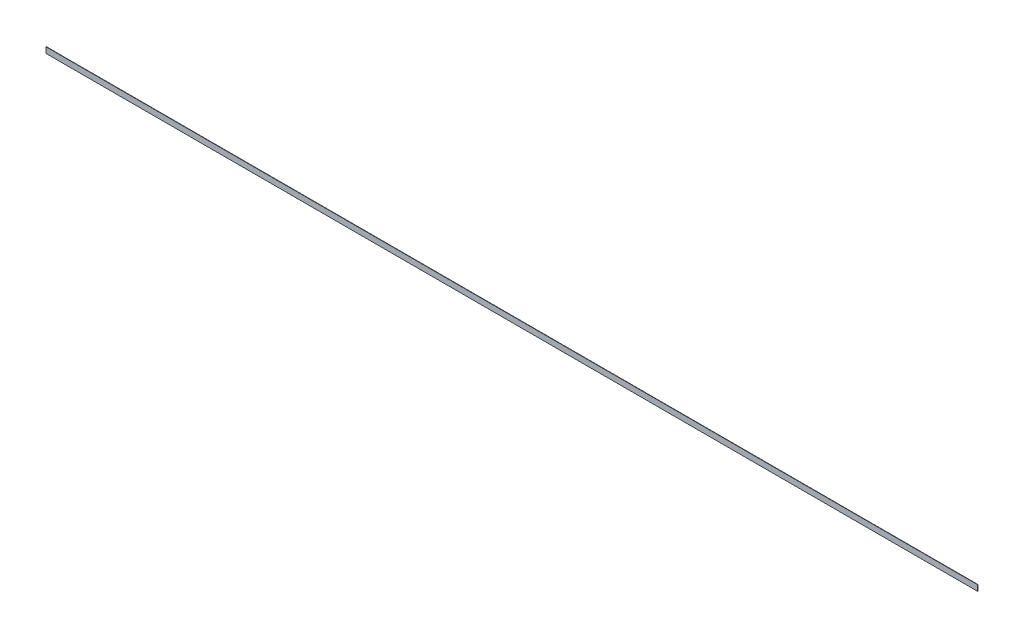
ISO-10303-21;
HEADER;
FILE_DESCRIPTION(('STEP AP214'),'2;1');
FILE_NAME('part.step','',(''),(''),'','','');
FILE_SCHEMA(('AUTOMOTIVE_DESIGN { 1 0 10303 214 1 1 1 1 }'));
ENDSEC;
DATA;
#1=APPLICATION_CONTEXT('core data for automotive mechanical design processes');
#2=APPLICATION_PROTOCOL_DEFINITION('international standard','automotive_design',2000,#1);
#3=PRODUCT_CONTEXT('',#1,'mechanical');
#4=PRODUCT('Part','Part','',(#3));
#5=PRODUCT_RELATED_PRODUCT_CATEGORY('part','',(#4));
#6=PRODUCT_DEFINITION_FORMATION('','',#4);
#7=PRODUCT_DEFINITION_CONTEXT('part definition',#1,'design');
#8=PRODUCT_DEFINITION('design','',#6,#7);
#9=PRODUCT_DEFINITION_SHAPE('','',#8);
#10=(LENGTH_UNIT() NAMED_UNIT(*) SI_UNIT(.MILLI.,.METRE.));
#11=(NAMED_UNIT(*) PLANE_ANGLE_UNIT() SI_UNIT($,.RADIAN.));
#12=(NAMED_UNIT(*) SI_UNIT($,.STERADIAN.) SOLID_ANGLE_UNIT());
#13=UNCERTAINTY_MEASURE_WITH_UNIT(LENGTH_MEASURE(1.E-05),#10,'distance_accuracy_value','');
#14=(GEOMETRIC_REPRESENTATION_CONTEXT(3) GLOBAL_UNCERTAINTY_ASSIGNED_CONTEXT((#13)) GLOBAL_UNIT_ASSIGNED_CONTEXT((#10,
#11,#12)) REPRESENTATION_CONTEXT('',''));
#15=CARTESIAN_POINT('',(0.,0.,0.));
#16=DIRECTION('',(0.,0.,1.));
#17=DIRECTION('',(1.,0.,0.));
#18=AXIS2_PLACEMENT_3D('',#15,#16,#17);
#19=CARTESIAN_POINT('',(-4114.8,25.4,0.));
#20=DIRECTION('',(0.,0.,1.));
#21=DIRECTION('',(1.,0.,0.));
#22=AXIS2_PLACEMENT_3D('',#19,#20,#21);
#23=PLANE('',#22);
#24=DIRECTION('',(1.,0.,0.));
#25=VECTOR('',#24,1.);
#26=CARTESIAN_POINT('',(-4114.8,25.4,0.));
#27=LINE('',#26,#25);
#28=CARTESIAN_POINT('',(-4114.8,25.4,0.));
#29=VERTEX_POINT('',#28);
#30=CARTESIAN_POINT('',(4114.8,25.4,0.));
#31=VERTEX_POINT('',#30);
#32=EDGE_CURVE('E19',#29,#31,#27,.T.);
#33=ORIENTED_EDGE('',*,*,#32,.F.);
#34=DIRECTION('',(0.,1.,0.));
#35=VECTOR('',#34,1.);
#36=CARTESIAN_POINT('',(-4114.8,0.,0.));
#37=LINE('',#36,#35);
#38=CARTESIAN_POINT('',(-4114.8,-25.4,0.));
#39=VERTEX_POINT('',#38);
#40=EDGE_CURVE('E79',#29,#39,#37,.F.);
#41=ORIENTED_EDGE('',*,*,#40,.T.);
#42=DIRECTION('',(1.,0.,0.));
#43=VECTOR('',#42,1.);
#44=CARTESIAN_POINT('',(-4114.8,-25.4,0.));
#45=LINE('',#44,#43);
#46=CARTESIAN_POINT('',(4114.8,-25.4,0.));
#47=VERTEX_POINT('',#46);
#48=EDGE_CURVE('E60',#47,#39,#45,.F.);
#49=ORIENTED_EDGE('',*,*,#48,.F.);
#50=DIRECTION('',(0.,1.,0.));
#51=VECTOR('',#50,1.);
#52=CARTESIAN_POINT('',(4114.8,0.,0.));
#53=LINE('',#52,#51);
#54=EDGE_CURVE('E55',#31,#47,#53,.F.);
#55=ORIENTED_EDGE('',*,*,#54,.F.);
#56=EDGE_LOOP('',(#33,#41,#49,#55));
#57=FACE_BOUND('',#56,.T.);
#58=ADVANCED_FACE('F16',(#57),#23,.T.);
#59=CARTESIAN_POINT('',(-4114.8,25.4,-3.175));
#60=DIRECTION('',(0.,1.,0.));
#61=DIRECTION('',(0.,0.,1.));
#62=AXIS2_PLACEMENT_3D('',#59,#60,#61);
#63=PLANE('',#62);
#64=DIRECTION('',(-1.,0.,0.));
#65=VECTOR('',#64,1.);
#66=CARTESIAN_POINT('',(-4114.8,25.4,-3.175));
#67=LINE('',#66,#65);
#68=CARTESIAN_POINT('',(-4114.8,25.4,-3.175));
#69=VERTEX_POINT('',#68);
#70=CARTESIAN_POINT('',(4114.8,25.4,-3.175));
#71=VERTEX_POINT('',#70);
#72=EDGE_CURVE('E82',#69,#71,#67,.F.);
#73=ORIENTED_EDGE('',*,*,#72,.F.);
#74=DIRECTION('',(0.,0.,-1.));
#75=VECTOR('',#74,1.);
#76=CARTESIAN_POINT('',(-4114.8,25.4,0.));
#77=LINE('',#76,#75);
#78=EDGE_CURVE('E67',#69,#29,#77,.F.);
#79=ORIENTED_EDGE('',*,*,#78,.T.);
#80=ORIENTED_EDGE('',*,*,#32,.T.);
#81=DIRECTION('',(0.,0.,-1.));
#82=VECTOR('',#81,1.);
#83=CARTESIAN_POINT('',(4114.8,25.4,0.));
#84=LINE('',#83,#82);
#85=EDGE_CURVE('E62',#71,#31,#84,.F.);
#86=ORIENTED_EDGE('',*,*,#85,.F.);
#87=EDGE_LOOP('',(#73,#79,#80,#86));
#88=FACE_BOUND('',#87,.T.);
#89=ADVANCED_FACE('F64',(#88),#63,.T.);
#90=CARTESIAN_POINT('',(4114.8,0.,0.));
#91=DIRECTION('',(1.,0.,0.));
#92=DIRECTION('',(0.,0.,-1.));
#93=AXIS2_PLACEMENT_3D('',#90,#91,#92);
#94=PLANE('',#93);
#95=DIRECTION('',(0.,1.,0.));
#96=VECTOR('',#95,1.);
#97=CARTESIAN_POINT('',(4114.8,-25.4,-3.175));
#98=LINE('',#97,#96);
#99=CARTESIAN_POINT('',(4114.8,-25.4,-3.175));
#100=VERTEX_POINT('',#99);
#101=EDGE_CURVE('E71',#71,#100,#98,.F.);
#102=ORIENTED_EDGE('',*,*,#101,.F.);
#103=ORIENTED_EDGE('',*,*,#85,.T.);
#104=ORIENTED_EDGE('',*,*,#54,.T.);
#105=DIRECTION('',(0.,0.,-1.));
#106=VECTOR('',#105,1.);
#107=CARTESIAN_POINT('',(4114.8,-25.4,0.));
#108=LINE('',#107,#106);
#109=EDGE_CURVE('E73',#100,#47,#108,.F.);
#110=ORIENTED_EDGE('',*,*,#109,.F.);
#111=EDGE_LOOP('',(#102,#103,#104,#110));
#112=FACE_BOUND('',#111,.T.);
#113=ADVANCED_FACE('F69',(#112),#94,.T.);
#114=CARTESIAN_POINT('',(-4114.8,-25.4,0.));
#115=DIRECTION('',(0.,-1.,0.));
#116=DIRECTION('',(0.,0.,-1.));
#117=AXIS2_PLACEMENT_3D('',#114,#115,#116);
#118=PLANE('',#117);
#119=ORIENTED_EDGE('',*,*,#48,.T.);
#120=DIRECTION('',(0.,0.,-1.));
#121=VECTOR('',#120,1.);
#122=CARTESIAN_POINT('',(-4114.8,-25.4,0.));
#123=LINE('',#122,#121);
#124=CARTESIAN_POINT('',(-4114.8,-25.4,-3.175));
#125=VERTEX_POINT('',#124);
#126=EDGE_CURVE('E34',#39,#125,#123,.T.);
#127=ORIENTED_EDGE('',*,*,#126,.T.);
#128=DIRECTION('',(-1.,0.,0.));
#129=VECTOR('',#128,1.);
#130=CARTESIAN_POINT('',(-4114.8,-25.4,-3.175));
#131=LINE('',#130,#129);
#132=EDGE_CURVE('E25',#100,#125,#131,.T.);
#133=ORIENTED_EDGE('',*,*,#132,.F.);
#134=ORIENTED_EDGE('',*,*,#109,.T.);
#135=EDGE_LOOP('',(#119,#127,#133,#134));
#136=FACE_BOUND('',#135,.T.);
#137=ADVANCED_FACE('F88',(#136),#118,.T.);
#138=CARTESIAN_POINT('',(-4114.8,0.,0.));
#139=DIRECTION('',(1.,0.,0.));
#140=DIRECTION('',(0.,0.,-1.));
#141=AXIS2_PLACEMENT_3D('',#138,#139,#140);
#142=PLANE('',#141);
#143=ORIENTED_EDGE('',*,*,#126,.F.);
#144=ORIENTED_EDGE('',*,*,#40,.F.);
#145=ORIENTED_EDGE('',*,*,#78,.F.);
#146=DIRECTION('',(0.,1.,0.));
#147=VECTOR('',#146,1.);
#148=CARTESIAN_POINT('',(-4114.8,-25.4,-3.175));
#149=LINE('',#148,#147);
#150=EDGE_CURVE('E11',#125,#69,#149,.T.);
#151=ORIENTED_EDGE('',*,*,#150,.F.);
#152=EDGE_LOOP('',(#143,#144,#145,#151));
#153=FACE_BOUND('',#152,.T.);
#154=ADVANCED_FACE('F90',(#153),#142,.F.);
#155=CARTESIAN_POINT('',(-4114.8,-25.4,-3.175));
#156=DIRECTION('',(0.,0.,-1.));
#157=DIRECTION('',(-1.,0.,0.));
#158=AXIS2_PLACEMENT_3D('',#155,#156,#157);
#159=PLANE('',#158);
#160=ORIENTED_EDGE('',*,*,#132,.T.);
#161=ORIENTED_EDGE('',*,*,#150,.T.);
#162=ORIENTED_EDGE('',*,*,#72,.T.);
#163=ORIENTED_EDGE('',*,*,#101,.T.);
#164=EDGE_LOOP('',(#160,#161,#162,#163));
#165=FACE_BOUND('',#164,.T.);
#166=ADVANCED_FACE('F87',(#165),#159,.T.);
#167=CLOSED_SHELL('',(#58,#89,#113,#137,#154,#166));
#168=MANIFOLD_SOLID_BREP('B1',#167);
#169=ADVANCED_BREP_SHAPE_REPRESENTATION('',(#18,#168),#14);
#170=SHAPE_DEFINITION_REPRESENTATION(#9,#169);
ENDSEC;
END-ISO-10303-21;
